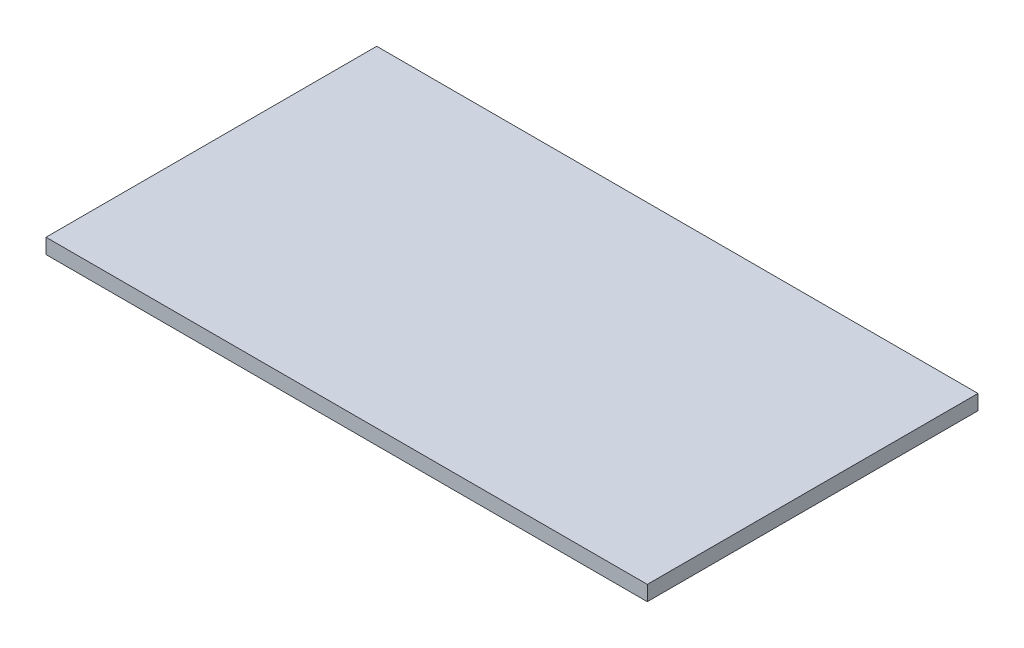
ISO-10303-21;
HEADER;
FILE_DESCRIPTION(('STEP AP214'),'2;1');
FILE_NAME('part.step','',(''),(''),'','','');
FILE_SCHEMA(('AUTOMOTIVE_DESIGN { 1 0 10303 214 1 1 1 1 }'));
ENDSEC;
DATA;
#1=APPLICATION_CONTEXT('core data for automotive mechanical design processes');
#2=APPLICATION_PROTOCOL_DEFINITION('international standard','automotive_design',2000,#1);
#3=PRODUCT_CONTEXT('',#1,'mechanical');
#4=PRODUCT('Part','Part','',(#3));
#5=PRODUCT_RELATED_PRODUCT_CATEGORY('part','',(#4));
#6=PRODUCT_DEFINITION_FORMATION('','',#4);
#7=PRODUCT_DEFINITION_CONTEXT('part definition',#1,'design');
#8=PRODUCT_DEFINITION('design','',#6,#7);
#9=PRODUCT_DEFINITION_SHAPE('','',#8);
#10=(LENGTH_UNIT() NAMED_UNIT(*) SI_UNIT(.MILLI.,.METRE.));
#11=(NAMED_UNIT(*) PLANE_ANGLE_UNIT() SI_UNIT($,.RADIAN.));
#12=(NAMED_UNIT(*) SI_UNIT($,.STERADIAN.) SOLID_ANGLE_UNIT());
#13=UNCERTAINTY_MEASURE_WITH_UNIT(LENGTH_MEASURE(1.E-05),#10,'distance_accuracy_value','');
#14=(GEOMETRIC_REPRESENTATION_CONTEXT(3) GLOBAL_UNCERTAINTY_ASSIGNED_CONTEXT((#13)) GLOBAL_UNIT_ASSIGNED_CONTEXT((#10,
#11,#12)) REPRESENTATION_CONTEXT('',''));
#15=CARTESIAN_POINT('',(0.,0.,0.));
#16=DIRECTION('',(0.,0.,1.));
#17=DIRECTION('',(1.,0.,0.));
#18=AXIS2_PLACEMENT_3D('',#15,#16,#17);
#19=CARTESIAN_POINT('',(800.,10.,-220.));
#20=DIRECTION('',(0.,0.,1.));
#21=DIRECTION('',(1.,0.,0.));
#22=AXIS2_PLACEMENT_3D('',#19,#20,#21);
#23=PLANE('',#22);
#24=DIRECTION('',(0.,1.,0.));
#25=VECTOR('',#24,1.);
#26=CARTESIAN_POINT('',(0.,10.,-220.));
#27=LINE('',#26,#25);
#28=CARTESIAN_POINT('',(0.,-10.,-220.));
#29=VERTEX_POINT('',#28);
#30=CARTESIAN_POINT('',(0.,10.,-220.));
#31=VERTEX_POINT('',#30);
#32=EDGE_CURVE('E96',#29,#31,#27,.T.);
#33=ORIENTED_EDGE('',*,*,#32,.T.);
#34=DIRECTION('',(-1.,0.,0.));
#35=VECTOR('',#34,1.);
#36=CARTESIAN_POINT('',(800.,10.,-220.));
#37=LINE('',#36,#35);
#38=CARTESIAN_POINT('',(800.,10.,-220.));
#39=VERTEX_POINT('',#38);
#40=EDGE_CURVE('E11',#39,#31,#37,.T.);
#41=ORIENTED_EDGE('',*,*,#40,.F.);
#42=DIRECTION('',(0.,1.,0.));
#43=VECTOR('',#42,1.);
#44=CARTESIAN_POINT('',(800.,10.,-220.));
#45=LINE('',#44,#43);
#46=CARTESIAN_POINT('',(800.,-10.,-220.));
#47=VERTEX_POINT('',#46);
#48=EDGE_CURVE('E84',#47,#39,#45,.T.);
#49=ORIENTED_EDGE('',*,*,#48,.F.);
#50=DIRECTION('',(-1.,0.,0.));
#51=VECTOR('',#50,1.);
#52=CARTESIAN_POINT('',(800.,-10.,-220.));
#53=LINE('',#52,#51);
#54=EDGE_CURVE('E92',#47,#29,#53,.T.);
#55=ORIENTED_EDGE('',*,*,#54,.T.);
#56=EDGE_LOOP('',(#33,#41,#49,#55));
#57=FACE_BOUND('',#56,.T.);
#58=ADVANCED_FACE('F33',(#57),#23,.F.);
#59=CARTESIAN_POINT('',(800.,10.,220.));
#60=DIRECTION('',(0.,-1.,0.));
#61=DIRECTION('',(0.,0.,-1.));
#62=AXIS2_PLACEMENT_3D('',#59,#60,#61);
#63=PLANE('',#62);
#64=DIRECTION('',(0.,0.,1.));
#65=VECTOR('',#64,1.);
#66=CARTESIAN_POINT('',(0.,10.,220.));
#67=LINE('',#66,#65);
#68=CARTESIAN_POINT('',(0.,10.,220.));
#69=VERTEX_POINT('',#68);
#70=EDGE_CURVE('E88',#31,#69,#67,.T.);
#71=ORIENTED_EDGE('',*,*,#70,.T.);
#72=DIRECTION('',(-1.,0.,0.));
#73=VECTOR('',#72,1.);
#74=CARTESIAN_POINT('',(800.,10.,220.));
#75=LINE('',#74,#73);
#76=CARTESIAN_POINT('',(800.,10.,220.));
#77=VERTEX_POINT('',#76);
#78=EDGE_CURVE('E41',#77,#69,#75,.T.);
#79=ORIENTED_EDGE('',*,*,#78,.F.);
#80=DIRECTION('',(0.,0.,1.));
#81=VECTOR('',#80,1.);
#82=CARTESIAN_POINT('',(800.,10.,220.));
#83=LINE('',#82,#81);
#84=EDGE_CURVE('E79',#39,#77,#83,.T.);
#85=ORIENTED_EDGE('',*,*,#84,.F.);
#86=ORIENTED_EDGE('',*,*,#40,.T.);
#87=EDGE_LOOP('',(#71,#79,#85,#86));
#88=FACE_BOUND('',#87,.T.);
#89=ADVANCED_FACE('F87',(#88),#63,.F.);
#90=CARTESIAN_POINT('',(800.,10.,220.));
#91=DIRECTION('',(0.,0.,-1.));
#92=DIRECTION('',(-1.,0.,0.));
#93=AXIS2_PLACEMENT_3D('',#90,#91,#92);
#94=PLANE('',#93);
#95=DIRECTION('',(0.,-1.,0.));
#96=VECTOR('',#95,1.);
#97=CARTESIAN_POINT('',(0.,10.,220.));
#98=LINE('',#97,#96);
#99=CARTESIAN_POINT('',(0.,-10.,220.));
#100=VERTEX_POINT('',#99);
#101=EDGE_CURVE('E66',#69,#100,#98,.T.);
#102=ORIENTED_EDGE('',*,*,#101,.T.);
#103=DIRECTION('',(-1.,0.,0.));
#104=VECTOR('',#103,1.);
#105=CARTESIAN_POINT('',(800.,-10.,220.));
#106=LINE('',#105,#104);
#107=CARTESIAN_POINT('',(800.,-10.,220.));
#108=VERTEX_POINT('',#107);
#109=EDGE_CURVE('E89',#108,#100,#106,.T.);
#110=ORIENTED_EDGE('',*,*,#109,.F.);
#111=DIRECTION('',(0.,-1.,0.));
#112=VECTOR('',#111,1.);
#113=CARTESIAN_POINT('',(800.,10.,220.));
#114=LINE('',#113,#112);
#115=EDGE_CURVE('E82',#77,#108,#114,.T.);
#116=ORIENTED_EDGE('',*,*,#115,.F.);
#117=ORIENTED_EDGE('',*,*,#78,.T.);
#118=EDGE_LOOP('',(#102,#110,#116,#117));
#119=FACE_BOUND('',#118,.T.);
#120=ADVANCED_FACE('F90',(#119),#94,.F.);
#121=CARTESIAN_POINT('',(800.,-10.,220.));
#122=DIRECTION('',(0.,1.,0.));
#123=DIRECTION('',(0.,0.,1.));
#124=AXIS2_PLACEMENT_3D('',#121,#122,#123);
#125=PLANE('',#124);
#126=DIRECTION('',(0.,0.,-1.));
#127=VECTOR('',#126,1.);
#128=CARTESIAN_POINT('',(0.,-10.,220.));
#129=LINE('',#128,#127);
#130=EDGE_CURVE('E72',#100,#29,#129,.T.);
#131=ORIENTED_EDGE('',*,*,#130,.T.);
#132=ORIENTED_EDGE('',*,*,#54,.F.);
#133=DIRECTION('',(0.,0.,-1.));
#134=VECTOR('',#133,1.);
#135=CARTESIAN_POINT('',(800.,-10.,220.));
#136=LINE('',#135,#134);
#137=EDGE_CURVE('E49',#108,#47,#136,.T.);
#138=ORIENTED_EDGE('',*,*,#137,.F.);
#139=ORIENTED_EDGE('',*,*,#109,.T.);
#140=EDGE_LOOP('',(#131,#132,#138,#139));
#141=FACE_BOUND('',#140,.T.);
#142=ADVANCED_FACE('F103',(#141),#125,.F.);
#143=CARTESIAN_POINT('',(800.,0.,0.));
#144=DIRECTION('',(1.,0.,0.));
#145=DIRECTION('',(0.,0.,-1.));
#146=AXIS2_PLACEMENT_3D('',#143,#144,#145);
#147=PLANE('',#146);
#148=ORIENTED_EDGE('',*,*,#48,.T.);
#149=ORIENTED_EDGE('',*,*,#84,.T.);
#150=ORIENTED_EDGE('',*,*,#115,.T.);
#151=ORIENTED_EDGE('',*,*,#137,.T.);
#152=EDGE_LOOP('',(#148,#149,#150,#151));
#153=FACE_BOUND('',#152,.T.);
#154=ADVANCED_FACE('F80',(#153),#147,.T.);
#155=CARTESIAN_POINT('',(0.,0.,0.));
#156=DIRECTION('',(1.,0.,0.));
#157=DIRECTION('',(0.,0.,-1.));
#158=AXIS2_PLACEMENT_3D('',#155,#156,#157);
#159=PLANE('',#158);
#160=ORIENTED_EDGE('',*,*,#32,.F.);
#161=ORIENTED_EDGE('',*,*,#130,.F.);
#162=ORIENTED_EDGE('',*,*,#101,.F.);
#163=ORIENTED_EDGE('',*,*,#70,.F.);
#164=EDGE_LOOP('',(#160,#161,#162,#163));
#165=FACE_BOUND('',#164,.T.);
#166=ADVANCED_FACE('F106',(#165),#159,.F.);
#167=CLOSED_SHELL('',(#58,#89,#120,#142,#154,#166));
#168=MANIFOLD_SOLID_BREP('B2',#167);
#169=ADVANCED_BREP_SHAPE_REPRESENTATION('',(#18,#168),#14);
#170=SHAPE_DEFINITION_REPRESENTATION(#9,#169);
ENDSEC;
END-ISO-10303-21;
